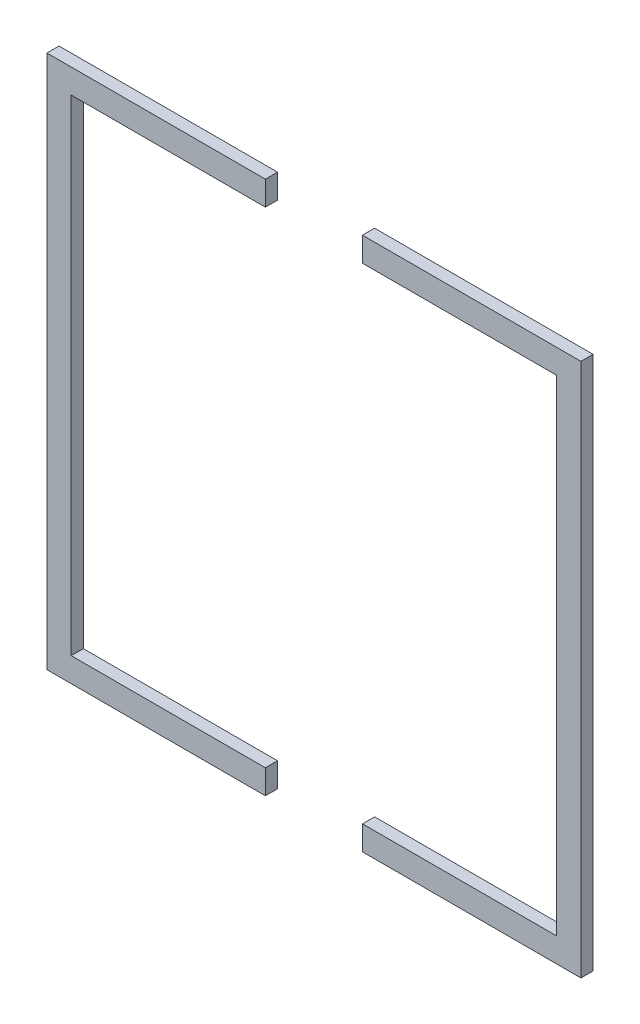
ISO-10303-21;
HEADER;
FILE_DESCRIPTION(('STEP AP214'),'2;1');
FILE_NAME('part.step','',(''),(''),'','','');
FILE_SCHEMA(('AUTOMOTIVE_DESIGN { 1 0 10303 214 1 1 1 1 }'));
ENDSEC;
DATA;
#1=APPLICATION_CONTEXT('core data for automotive mechanical design processes');
#2=APPLICATION_PROTOCOL_DEFINITION('international standard','automotive_design',2000,#1);
#3=PRODUCT_CONTEXT('',#1,'mechanical');
#4=PRODUCT('Part','Part','',(#3));
#5=PRODUCT_RELATED_PRODUCT_CATEGORY('part','',(#4));
#6=PRODUCT_DEFINITION_FORMATION('','',#4);
#7=PRODUCT_DEFINITION_CONTEXT('part definition',#1,'design');
#8=PRODUCT_DEFINITION('design','',#6,#7);
#9=PRODUCT_DEFINITION_SHAPE('','',#8);
#10=(LENGTH_UNIT() NAMED_UNIT(*) SI_UNIT(.MILLI.,.METRE.));
#11=(NAMED_UNIT(*) PLANE_ANGLE_UNIT() SI_UNIT($,.RADIAN.));
#12=(NAMED_UNIT(*) SI_UNIT($,.STERADIAN.) SOLID_ANGLE_UNIT());
#13=UNCERTAINTY_MEASURE_WITH_UNIT(LENGTH_MEASURE(1.E-05),#10,'distance_accuracy_value','');
#14=(GEOMETRIC_REPRESENTATION_CONTEXT(3) GLOBAL_UNCERTAINTY_ASSIGNED_CONTEXT((#13)) GLOBAL_UNIT_ASSIGNED_CONTEXT((#10,
#11,#12)) REPRESENTATION_CONTEXT('',''));
#15=CARTESIAN_POINT('',(0.,0.,0.));
#16=DIRECTION('',(0.,0.,1.));
#17=DIRECTION('',(1.,0.,0.));
#18=AXIS2_PLACEMENT_3D('',#15,#16,#17);
#19=CARTESIAN_POINT('',(82.55,139.7,3.175));
#20=DIRECTION('',(0.,-1.,0.));
#21=DIRECTION('',(1.,0.,0.));
#22=AXIS2_PLACEMENT_3D('',#19,#20,#21);
#23=PLANE('',#22);
#24=DIRECTION('',(-1.,0.,0.));
#25=VECTOR('',#24,1.);
#26=CARTESIAN_POINT('',(82.55,139.7,0.));
#27=LINE('',#26,#25);
#28=CARTESIAN_POINT('',(139.7,139.7,0.));
#29=VERTEX_POINT('',#28);
#30=CARTESIAN_POINT('',(82.55,139.7,0.));
#31=VERTEX_POINT('',#30);
#32=EDGE_CURVE('E139',#29,#31,#27,.T.);
#33=ORIENTED_EDGE('',*,*,#32,.T.);
#34=DIRECTION('',(0.,0.,-1.));
#35=VECTOR('',#34,1.);
#36=CARTESIAN_POINT('',(82.55,139.7,3.175));
#37=LINE('',#36,#35);
#38=CARTESIAN_POINT('',(82.55,139.7,3.175));
#39=VERTEX_POINT('',#38);
#40=EDGE_CURVE('E12',#39,#31,#37,.T.);
#41=ORIENTED_EDGE('',*,*,#40,.F.);
#42=DIRECTION('',(-1.,0.,0.));
#43=VECTOR('',#42,1.);
#44=CARTESIAN_POINT('',(82.55,139.7,3.175));
#45=LINE('',#44,#43);
#46=CARTESIAN_POINT('',(139.7,139.7,3.175));
#47=VERTEX_POINT('',#46);
#48=EDGE_CURVE('E153',#47,#39,#45,.T.);
#49=ORIENTED_EDGE('',*,*,#48,.F.);
#50=DIRECTION('',(0.,0.,-1.));
#51=VECTOR('',#50,1.);
#52=CARTESIAN_POINT('',(139.7,139.7,3.175));
#53=LINE('',#52,#51);
#54=EDGE_CURVE('E135',#47,#29,#53,.T.);
#55=ORIENTED_EDGE('',*,*,#54,.T.);
#56=EDGE_LOOP('',(#33,#41,#49,#55));
#57=FACE_BOUND('',#56,.T.);
#58=ADVANCED_FACE('F43',(#57),#23,.F.);
#59=CARTESIAN_POINT('',(82.55,133.35,3.175));
#60=DIRECTION('',(1.,0.,0.));
#61=DIRECTION('',(0.,0.,-1.));
#62=AXIS2_PLACEMENT_3D('',#59,#60,#61);
#63=PLANE('',#62);
#64=DIRECTION('',(0.,-1.,0.));
#65=VECTOR('',#64,1.);
#66=CARTESIAN_POINT('',(82.55,133.35,0.));
#67=LINE('',#66,#65);
#68=CARTESIAN_POINT('',(82.55,133.35,0.));
#69=VERTEX_POINT('',#68);
#70=EDGE_CURVE('E142',#31,#69,#67,.T.);
#71=ORIENTED_EDGE('',*,*,#70,.T.);
#72=DIRECTION('',(0.,0.,-1.));
#73=VECTOR('',#72,1.);
#74=CARTESIAN_POINT('',(82.55,133.35,3.175));
#75=LINE('',#74,#73);
#76=CARTESIAN_POINT('',(82.55,133.35,3.175));
#77=VERTEX_POINT('',#76);
#78=EDGE_CURVE('E51',#77,#69,#75,.T.);
#79=ORIENTED_EDGE('',*,*,#78,.F.);
#80=DIRECTION('',(0.,-1.,0.));
#81=VECTOR('',#80,1.);
#82=CARTESIAN_POINT('',(82.55,133.35,3.175));
#83=LINE('',#82,#81);
#84=EDGE_CURVE('E102',#39,#77,#83,.T.);
#85=ORIENTED_EDGE('',*,*,#84,.F.);
#86=ORIENTED_EDGE('',*,*,#40,.T.);
#87=EDGE_LOOP('',(#71,#79,#85,#86));
#88=FACE_BOUND('',#87,.T.);
#89=ADVANCED_FACE('F188',(#88),#63,.F.);
#90=CARTESIAN_POINT('',(82.55,133.35,3.175));
#91=DIRECTION('',(0.,1.,0.));
#92=DIRECTION('',(0.,0.,1.));
#93=AXIS2_PLACEMENT_3D('',#90,#91,#92);
#94=PLANE('',#93);
#95=DIRECTION('',(1.,0.,0.));
#96=VECTOR('',#95,1.);
#97=CARTESIAN_POINT('',(82.55,133.35,0.));
#98=LINE('',#97,#96);
#99=CARTESIAN_POINT('',(133.35,133.35,0.));
#100=VERTEX_POINT('',#99);
#101=EDGE_CURVE('E144',#69,#100,#98,.T.);
#102=ORIENTED_EDGE('',*,*,#101,.T.);
#103=DIRECTION('',(0.,0.,-1.));
#104=VECTOR('',#103,1.);
#105=CARTESIAN_POINT('',(133.35,133.35,3.175));
#106=LINE('',#105,#104);
#107=CARTESIAN_POINT('',(133.35,133.35,3.175));
#108=VERTEX_POINT('',#107);
#109=EDGE_CURVE('E160',#108,#100,#106,.T.);
#110=ORIENTED_EDGE('',*,*,#109,.F.);
#111=DIRECTION('',(1.,0.,0.));
#112=VECTOR('',#111,1.);
#113=CARTESIAN_POINT('',(82.55,133.35,3.175));
#114=LINE('',#113,#112);
#115=EDGE_CURVE('E168',#77,#108,#114,.T.);
#116=ORIENTED_EDGE('',*,*,#115,.F.);
#117=ORIENTED_EDGE('',*,*,#78,.T.);
#118=EDGE_LOOP('',(#102,#110,#116,#117));
#119=FACE_BOUND('',#118,.T.);
#120=ADVANCED_FACE('F166',(#119),#94,.F.);
#121=CARTESIAN_POINT('',(133.35,133.35,3.175));
#122=DIRECTION('',(1.,0.,0.));
#123=DIRECTION('',(0.,1.,0.));
#124=AXIS2_PLACEMENT_3D('',#121,#122,#123);
#125=PLANE('',#124);
#126=DIRECTION('',(0.,-1.,0.));
#127=VECTOR('',#126,1.);
#128=CARTESIAN_POINT('',(133.35,133.35,0.));
#129=LINE('',#128,#127);
#130=CARTESIAN_POINT('',(133.35,6.35,0.));
#131=VERTEX_POINT('',#130);
#132=EDGE_CURVE('E146',#100,#131,#129,.T.);
#133=ORIENTED_EDGE('',*,*,#132,.T.);
#134=DIRECTION('',(0.,0.,-1.));
#135=VECTOR('',#134,1.);
#136=CARTESIAN_POINT('',(133.35,6.35,3.175));
#137=LINE('',#136,#135);
#138=CARTESIAN_POINT('',(133.35,6.35,3.175));
#139=VERTEX_POINT('',#138);
#140=EDGE_CURVE('E157',#139,#131,#137,.T.);
#141=ORIENTED_EDGE('',*,*,#140,.F.);
#142=DIRECTION('',(0.,-1.,0.));
#143=VECTOR('',#142,1.);
#144=CARTESIAN_POINT('',(133.35,133.35,3.175));
#145=LINE('',#144,#143);
#146=EDGE_CURVE('E180',#108,#139,#145,.T.);
#147=ORIENTED_EDGE('',*,*,#146,.F.);
#148=ORIENTED_EDGE('',*,*,#109,.T.);
#149=EDGE_LOOP('',(#133,#141,#147,#148));
#150=FACE_BOUND('',#149,.T.);
#151=ADVANCED_FACE('F176',(#150),#125,.F.);
#152=CARTESIAN_POINT('',(82.55,6.35,3.175));
#153=DIRECTION('',(0.,-1.,0.));
#154=DIRECTION('',(0.,0.,-1.));
#155=AXIS2_PLACEMENT_3D('',#152,#153,#154);
#156=PLANE('',#155);
#157=DIRECTION('',(-1.,0.,0.));
#158=VECTOR('',#157,1.);
#159=CARTESIAN_POINT('',(82.55,6.35,0.));
#160=LINE('',#159,#158);
#161=CARTESIAN_POINT('',(82.55,6.35,0.));
#162=VERTEX_POINT('',#161);
#163=EDGE_CURVE('E148',#131,#162,#160,.T.);
#164=ORIENTED_EDGE('',*,*,#163,.T.);
#165=DIRECTION('',(0.,0.,-1.));
#166=VECTOR('',#165,1.);
#167=CARTESIAN_POINT('',(82.55,6.35,3.175));
#168=LINE('',#167,#166);
#169=CARTESIAN_POINT('',(82.55,6.35,3.175));
#170=VERTEX_POINT('',#169);
#171=EDGE_CURVE('E130',#170,#162,#168,.T.);
#172=ORIENTED_EDGE('',*,*,#171,.F.);
#173=DIRECTION('',(-1.,0.,0.));
#174=VECTOR('',#173,1.);
#175=CARTESIAN_POINT('',(82.55,6.35,3.175));
#176=LINE('',#175,#174);
#177=EDGE_CURVE('E121',#139,#170,#176,.T.);
#178=ORIENTED_EDGE('',*,*,#177,.F.);
#179=ORIENTED_EDGE('',*,*,#140,.T.);
#180=EDGE_LOOP('',(#164,#172,#178,#179));
#181=FACE_BOUND('',#180,.T.);
#182=ADVANCED_FACE('F179',(#181),#156,.F.);
#183=CARTESIAN_POINT('',(82.55,6.35,3.175));
#184=DIRECTION('',(1.,0.,0.));
#185=DIRECTION('',(0.,0.,-1.));
#186=AXIS2_PLACEMENT_3D('',#183,#184,#185);
#187=PLANE('',#186);
#188=DIRECTION('',(0.,-1.,0.));
#189=VECTOR('',#188,1.);
#190=CARTESIAN_POINT('',(82.55,6.35,0.));
#191=LINE('',#190,#189);
#192=CARTESIAN_POINT('',(82.55,0.,0.));
#193=VERTEX_POINT('',#192);
#194=EDGE_CURVE('E129',#162,#193,#191,.T.);
#195=ORIENTED_EDGE('',*,*,#194,.T.);
#196=DIRECTION('',(0.,0.,-1.));
#197=VECTOR('',#196,1.);
#198=CARTESIAN_POINT('',(82.55,0.,3.175));
#199=LINE('',#198,#197);
#200=CARTESIAN_POINT('',(82.55,0.,3.175));
#201=VERTEX_POINT('',#200);
#202=EDGE_CURVE('E126',#201,#193,#199,.T.);
#203=ORIENTED_EDGE('',*,*,#202,.F.);
#204=DIRECTION('',(0.,-1.,0.));
#205=VECTOR('',#204,1.);
#206=CARTESIAN_POINT('',(82.55,6.35,3.175));
#207=LINE('',#206,#205);
#208=EDGE_CURVE('E115',#170,#201,#207,.T.);
#209=ORIENTED_EDGE('',*,*,#208,.F.);
#210=ORIENTED_EDGE('',*,*,#171,.T.);
#211=EDGE_LOOP('',(#195,#203,#209,#210));
#212=FACE_BOUND('',#211,.T.);
#213=ADVANCED_FACE('F127',(#212),#187,.F.);
#214=CARTESIAN_POINT('',(82.55,0.,3.175));
#215=DIRECTION('',(0.,1.,0.));
#216=DIRECTION('',(0.,0.,1.));
#217=AXIS2_PLACEMENT_3D('',#214,#215,#216);
#218=PLANE('',#217);
#219=DIRECTION('',(1.,0.,0.));
#220=VECTOR('',#219,1.);
#221=CARTESIAN_POINT('',(82.55,0.,0.));
#222=LINE('',#221,#220);
#223=CARTESIAN_POINT('',(139.7,0.,0.));
#224=VERTEX_POINT('',#223);
#225=EDGE_CURVE('E88',#193,#224,#222,.T.);
#226=ORIENTED_EDGE('',*,*,#225,.T.);
#227=DIRECTION('',(0.,0.,-1.));
#228=VECTOR('',#227,1.);
#229=CARTESIAN_POINT('',(139.7,0.,3.175));
#230=LINE('',#229,#228);
#231=CARTESIAN_POINT('',(139.7,0.,3.175));
#232=VERTEX_POINT('',#231);
#233=EDGE_CURVE('E131',#232,#224,#230,.T.);
#234=ORIENTED_EDGE('',*,*,#233,.F.);
#235=DIRECTION('',(1.,0.,0.));
#236=VECTOR('',#235,1.);
#237=CARTESIAN_POINT('',(82.55,0.,3.175));
#238=LINE('',#237,#236);
#239=EDGE_CURVE('E119',#201,#232,#238,.T.);
#240=ORIENTED_EDGE('',*,*,#239,.F.);
#241=ORIENTED_EDGE('',*,*,#202,.T.);
#242=EDGE_LOOP('',(#226,#234,#240,#241));
#243=FACE_BOUND('',#242,.T.);
#244=ADVANCED_FACE('F133',(#243),#218,.F.);
#245=CARTESIAN_POINT('',(139.7,0.,3.175));
#246=DIRECTION('',(-1.,0.,0.));
#247=DIRECTION('',(0.,0.,1.));
#248=AXIS2_PLACEMENT_3D('',#245,#246,#247);
#249=PLANE('',#248);
#250=DIRECTION('',(0.,1.,0.));
#251=VECTOR('',#250,1.);
#252=CARTESIAN_POINT('',(139.7,0.,0.));
#253=LINE('',#252,#251);
#254=EDGE_CURVE('E94',#224,#29,#253,.T.);
#255=ORIENTED_EDGE('',*,*,#254,.T.);
#256=ORIENTED_EDGE('',*,*,#54,.F.);
#257=DIRECTION('',(0.,1.,0.));
#258=VECTOR('',#257,1.);
#259=CARTESIAN_POINT('',(139.7,0.,3.175));
#260=LINE('',#259,#258);
#261=EDGE_CURVE('E59',#232,#47,#260,.T.);
#262=ORIENTED_EDGE('',*,*,#261,.F.);
#263=ORIENTED_EDGE('',*,*,#233,.T.);
#264=EDGE_LOOP('',(#255,#256,#262,#263));
#265=FACE_BOUND('',#264,.T.);
#266=ADVANCED_FACE('F204',(#265),#249,.F.);
#267=CARTESIAN_POINT('',(0.,0.,3.175));
#268=DIRECTION('',(0.,0.,1.));
#269=DIRECTION('',(1.,0.,0.));
#270=AXIS2_PLACEMENT_3D('',#267,#268,#269);
#271=PLANE('',#270);
#272=ORIENTED_EDGE('',*,*,#48,.T.);
#273=ORIENTED_EDGE('',*,*,#84,.T.);
#274=ORIENTED_EDGE('',*,*,#115,.T.);
#275=ORIENTED_EDGE('',*,*,#146,.T.);
#276=ORIENTED_EDGE('',*,*,#177,.T.);
#277=ORIENTED_EDGE('',*,*,#208,.T.);
#278=ORIENTED_EDGE('',*,*,#239,.T.);
#279=ORIENTED_EDGE('',*,*,#261,.T.);
#280=EDGE_LOOP('',(#272,#273,#274,#275,#276,#277,#278,#279));
#281=FACE_BOUND('',#280,.T.);
#282=ADVANCED_FACE('F117',(#281),#271,.T.);
#283=CARTESIAN_POINT('',(0.,0.,0.));
#284=DIRECTION('',(0.,0.,1.));
#285=DIRECTION('',(1.,0.,0.));
#286=AXIS2_PLACEMENT_3D('',#283,#284,#285);
#287=PLANE('',#286);
#288=ORIENTED_EDGE('',*,*,#32,.F.);
#289=ORIENTED_EDGE('',*,*,#254,.F.);
#290=ORIENTED_EDGE('',*,*,#225,.F.);
#291=ORIENTED_EDGE('',*,*,#194,.F.);
#292=ORIENTED_EDGE('',*,*,#163,.F.);
#293=ORIENTED_EDGE('',*,*,#132,.F.);
#294=ORIENTED_EDGE('',*,*,#101,.F.);
#295=ORIENTED_EDGE('',*,*,#70,.F.);
#296=EDGE_LOOP('',(#288,#289,#290,#291,#292,#293,#294,#295));
#297=FACE_BOUND('',#296,.T.);
#298=ADVANCED_FACE('F172',(#297),#287,.F.);
#299=CLOSED_SHELL('',(#58,#89,#120,#151,#182,#213,#244,#266,#282,#298));
#300=MANIFOLD_SOLID_BREP('B2',#299);
#301=CARTESIAN_POINT('',(0.,0.,3.175));
#302=DIRECTION('',(1.,0.,0.));
#303=DIRECTION('',(0.,0.,-1.));
#304=AXIS2_PLACEMENT_3D('',#301,#302,#303);
#305=PLANE('',#304);
#306=DIRECTION('',(0.,-1.,0.));
#307=VECTOR('',#306,1.);
#308=CARTESIAN_POINT('',(0.,0.,0.));
#309=LINE('',#308,#307);
#310=CARTESIAN_POINT('',(0.,139.7,0.));
#311=VERTEX_POINT('',#310);
#312=CARTESIAN_POINT('',(0.,0.,0.));
#313=VERTEX_POINT('',#312);
#314=EDGE_CURVE('E367',#311,#313,#309,.T.);
#315=ORIENTED_EDGE('',*,*,#314,.T.);
#316=DIRECTION('',(0.,0.,-1.));
#317=VECTOR('',#316,1.);
#318=CARTESIAN_POINT('',(0.,0.,3.175));
#319=LINE('',#318,#317);
#320=CARTESIAN_POINT('',(0.,0.,3.175));
#321=VERTEX_POINT('',#320);
#322=EDGE_CURVE('E41',#321,#313,#319,.T.);
#323=ORIENTED_EDGE('',*,*,#322,.F.);
#324=DIRECTION('',(0.,-1.,0.));
#325=VECTOR('',#324,1.);
#326=CARTESIAN_POINT('',(0.,0.,3.175));
#327=LINE('',#326,#325);
#328=CARTESIAN_POINT('',(0.,139.7,3.175));
#329=VERTEX_POINT('',#328);
#330=EDGE_CURVE('E381',#329,#321,#327,.T.);
#331=ORIENTED_EDGE('',*,*,#330,.F.);
#332=DIRECTION('',(0.,0.,-1.));
#333=VECTOR('',#332,1.);
#334=CARTESIAN_POINT('',(0.,139.7,3.175));
#335=LINE('',#334,#333);
#336=EDGE_CURVE('E363',#329,#311,#335,.T.);
#337=ORIENTED_EDGE('',*,*,#336,.T.);
#338=EDGE_LOOP('',(#315,#323,#331,#337));
#339=FACE_BOUND('',#338,.T.);
#340=ADVANCED_FACE('F271',(#339),#305,.F.);
#341=CARTESIAN_POINT('',(0.,0.,3.175));
#342=DIRECTION('',(0.,1.,0.));
#343=DIRECTION('',(0.,0.,1.));
#344=AXIS2_PLACEMENT_3D('',#341,#342,#343);
#345=PLANE('',#344);
#346=DIRECTION('',(1.,0.,0.));
#347=VECTOR('',#346,1.);
#348=CARTESIAN_POINT('',(0.,0.,0.));
#349=LINE('',#348,#347);
#350=CARTESIAN_POINT('',(57.15,0.,0.));
#351=VERTEX_POINT('',#350);
#352=EDGE_CURVE('E370',#313,#351,#349,.T.);
#353=ORIENTED_EDGE('',*,*,#352,.T.);
#354=DIRECTION('',(0.,0.,-1.));
#355=VECTOR('',#354,1.);
#356=CARTESIAN_POINT('',(57.15,0.,3.175));
#357=LINE('',#356,#355);
#358=CARTESIAN_POINT('',(57.15,0.,3.175));
#359=VERTEX_POINT('',#358);
#360=EDGE_CURVE('E279',#359,#351,#357,.T.);
#361=ORIENTED_EDGE('',*,*,#360,.F.);
#362=DIRECTION('',(1.,0.,0.));
#363=VECTOR('',#362,1.);
#364=CARTESIAN_POINT('',(0.,0.,3.175));
#365=LINE('',#364,#363);
#366=EDGE_CURVE('E330',#321,#359,#365,.T.);
#367=ORIENTED_EDGE('',*,*,#366,.F.);
#368=ORIENTED_EDGE('',*,*,#322,.T.);
#369=EDGE_LOOP('',(#353,#361,#367,#368));
#370=FACE_BOUND('',#369,.T.);
#371=ADVANCED_FACE('F416',(#370),#345,.F.);
#372=CARTESIAN_POINT('',(57.15,6.35,3.175));
#373=DIRECTION('',(-1.,0.,0.));
#374=DIRECTION('',(0.,0.,1.));
#375=AXIS2_PLACEMENT_3D('',#372,#373,#374);
#376=PLANE('',#375);
#377=DIRECTION('',(0.,1.,0.));
#378=VECTOR('',#377,1.);
#379=CARTESIAN_POINT('',(57.15,6.35,0.));
#380=LINE('',#379,#378);
#381=CARTESIAN_POINT('',(57.15,6.35,0.));
#382=VERTEX_POINT('',#381);
#383=EDGE_CURVE('E372',#351,#382,#380,.T.);
#384=ORIENTED_EDGE('',*,*,#383,.T.);
#385=DIRECTION('',(0.,0.,-1.));
#386=VECTOR('',#385,1.);
#387=CARTESIAN_POINT('',(57.15,6.35,3.175));
#388=LINE('',#387,#386);
#389=CARTESIAN_POINT('',(57.15,6.35,3.175));
#390=VERTEX_POINT('',#389);
#391=EDGE_CURVE('E388',#390,#382,#388,.T.);
#392=ORIENTED_EDGE('',*,*,#391,.F.);
#393=DIRECTION('',(0.,1.,0.));
#394=VECTOR('',#393,1.);
#395=CARTESIAN_POINT('',(57.15,6.35,3.175));
#396=LINE('',#395,#394);
#397=EDGE_CURVE('E396',#359,#390,#396,.T.);
#398=ORIENTED_EDGE('',*,*,#397,.F.);
#399=ORIENTED_EDGE('',*,*,#360,.T.);
#400=EDGE_LOOP('',(#384,#392,#398,#399));
#401=FACE_BOUND('',#400,.T.);
#402=ADVANCED_FACE('F394',(#401),#376,.F.);
#403=CARTESIAN_POINT('',(6.35,6.35,3.175));
#404=DIRECTION('',(0.,-1.,0.));
#405=DIRECTION('',(0.,0.,-1.));
#406=AXIS2_PLACEMENT_3D('',#403,#404,#405);
#407=PLANE('',#406);
#408=DIRECTION('',(-1.,0.,0.));
#409=VECTOR('',#408,1.);
#410=CARTESIAN_POINT('',(6.35,6.35,0.));
#411=LINE('',#410,#409);
#412=CARTESIAN_POINT('',(6.35,6.35,0.));
#413=VERTEX_POINT('',#412);
#414=EDGE_CURVE('E374',#382,#413,#411,.T.);
#415=ORIENTED_EDGE('',*,*,#414,.T.);
#416=DIRECTION('',(0.,0.,-1.));
#417=VECTOR('',#416,1.);
#418=CARTESIAN_POINT('',(6.35,6.35,3.175));
#419=LINE('',#418,#417);
#420=CARTESIAN_POINT('',(6.35,6.35,3.175));
#421=VERTEX_POINT('',#420);
#422=EDGE_CURVE('E385',#421,#413,#419,.T.);
#423=ORIENTED_EDGE('',*,*,#422,.F.);
#424=DIRECTION('',(-1.,0.,0.));
#425=VECTOR('',#424,1.);
#426=CARTESIAN_POINT('',(6.35,6.35,3.175));
#427=LINE('',#426,#425);
#428=EDGE_CURVE('E408',#390,#421,#427,.T.);
#429=ORIENTED_EDGE('',*,*,#428,.F.);
#430=ORIENTED_EDGE('',*,*,#391,.T.);
#431=EDGE_LOOP('',(#415,#423,#429,#430));
#432=FACE_BOUND('',#431,.T.);
#433=ADVANCED_FACE('F404',(#432),#407,.F.);
#434=CARTESIAN_POINT('',(6.35,133.35,3.175));
#435=DIRECTION('',(-1.,0.,0.));
#436=DIRECTION('',(0.,0.,1.));
#437=AXIS2_PLACEMENT_3D('',#434,#435,#436);
#438=PLANE('',#437);
#439=DIRECTION('',(0.,1.,0.));
#440=VECTOR('',#439,1.);
#441=CARTESIAN_POINT('',(6.35,133.35,0.));
#442=LINE('',#441,#440);
#443=CARTESIAN_POINT('',(6.35,133.35,0.));
#444=VERTEX_POINT('',#443);
#445=EDGE_CURVE('E376',#413,#444,#442,.T.);
#446=ORIENTED_EDGE('',*,*,#445,.T.);
#447=DIRECTION('',(0.,0.,-1.));
#448=VECTOR('',#447,1.);
#449=CARTESIAN_POINT('',(6.35,133.35,3.175));
#450=LINE('',#449,#448);
#451=CARTESIAN_POINT('',(6.35,133.35,3.175));
#452=VERTEX_POINT('',#451);
#453=EDGE_CURVE('E358',#452,#444,#450,.T.);
#454=ORIENTED_EDGE('',*,*,#453,.F.);
#455=DIRECTION('',(0.,1.,0.));
#456=VECTOR('',#455,1.);
#457=CARTESIAN_POINT('',(6.35,133.35,3.175));
#458=LINE('',#457,#456);
#459=EDGE_CURVE('E349',#421,#452,#458,.T.);
#460=ORIENTED_EDGE('',*,*,#459,.F.);
#461=ORIENTED_EDGE('',*,*,#422,.T.);
#462=EDGE_LOOP('',(#446,#454,#460,#461));
#463=FACE_BOUND('',#462,.T.);
#464=ADVANCED_FACE('F407',(#463),#438,.F.);
#465=CARTESIAN_POINT('',(6.35,133.35,3.175));
#466=DIRECTION('',(0.,1.,0.));
#467=DIRECTION('',(0.,0.,1.));
#468=AXIS2_PLACEMENT_3D('',#465,#466,#467);
#469=PLANE('',#468);
#470=DIRECTION('',(1.,0.,0.));
#471=VECTOR('',#470,1.);
#472=CARTESIAN_POINT('',(6.35,133.35,0.));
#473=LINE('',#472,#471);
#474=CARTESIAN_POINT('',(57.15,133.35,0.));
#475=VERTEX_POINT('',#474);
#476=EDGE_CURVE('E357',#444,#475,#473,.T.);
#477=ORIENTED_EDGE('',*,*,#476,.T.);
#478=DIRECTION('',(0.,0.,-1.));
#479=VECTOR('',#478,1.);
#480=CARTESIAN_POINT('',(57.15,133.35,3.175));
#481=LINE('',#480,#479);
#482=CARTESIAN_POINT('',(57.15,133.35,3.175));
#483=VERTEX_POINT('',#482);
#484=EDGE_CURVE('E354',#483,#475,#481,.T.);
#485=ORIENTED_EDGE('',*,*,#484,.F.);
#486=DIRECTION('',(1.,0.,0.));
#487=VECTOR('',#486,1.);
#488=CARTESIAN_POINT('',(6.35,133.35,3.175));
#489=LINE('',#488,#487);
#490=EDGE_CURVE('E343',#452,#483,#489,.T.);
#491=ORIENTED_EDGE('',*,*,#490,.F.);
#492=ORIENTED_EDGE('',*,*,#453,.T.);
#493=EDGE_LOOP('',(#477,#485,#491,#492));
#494=FACE_BOUND('',#493,.T.);
#495=ADVANCED_FACE('F355',(#494),#469,.F.);
#496=CARTESIAN_POINT('',(57.15,139.7,3.175));
#497=DIRECTION('',(-1.,0.,0.));
#498=DIRECTION('',(0.,0.,1.));
#499=AXIS2_PLACEMENT_3D('',#496,#497,#498);
#500=PLANE('',#499);
#501=DIRECTION('',(0.,1.,0.));
#502=VECTOR('',#501,1.);
#503=CARTESIAN_POINT('',(57.15,139.7,0.));
#504=LINE('',#503,#502);
#505=CARTESIAN_POINT('',(57.15,139.7,0.));
#506=VERTEX_POINT('',#505);
#507=EDGE_CURVE('E316',#475,#506,#504,.T.);
#508=ORIENTED_EDGE('',*,*,#507,.T.);
#509=DIRECTION('',(0.,0.,-1.));
#510=VECTOR('',#509,1.);
#511=CARTESIAN_POINT('',(57.15,139.7,3.175));
#512=LINE('',#511,#510);
#513=CARTESIAN_POINT('',(57.15,139.7,3.175));
#514=VERTEX_POINT('',#513);
#515=EDGE_CURVE('E359',#514,#506,#512,.T.);
#516=ORIENTED_EDGE('',*,*,#515,.F.);
#517=DIRECTION('',(0.,1.,0.));
#518=VECTOR('',#517,1.);
#519=CARTESIAN_POINT('',(57.15,139.7,3.175));
#520=LINE('',#519,#518);
#521=EDGE_CURVE('E347',#483,#514,#520,.T.);
#522=ORIENTED_EDGE('',*,*,#521,.F.);
#523=ORIENTED_EDGE('',*,*,#484,.T.);
#524=EDGE_LOOP('',(#508,#516,#522,#523));
#525=FACE_BOUND('',#524,.T.);
#526=ADVANCED_FACE('F361',(#525),#500,.F.);
#527=CARTESIAN_POINT('',(57.15,139.7,3.175));
#528=DIRECTION('',(0.,-1.,0.));
#529=DIRECTION('',(0.,0.,-1.));
#530=AXIS2_PLACEMENT_3D('',#527,#528,#529);
#531=PLANE('',#530);
#532=DIRECTION('',(-1.,0.,0.));
#533=VECTOR('',#532,1.);
#534=CARTESIAN_POINT('',(57.15,139.7,0.));
#535=LINE('',#534,#533);
#536=EDGE_CURVE('E322',#506,#311,#535,.T.);
#537=ORIENTED_EDGE('',*,*,#536,.T.);
#538=ORIENTED_EDGE('',*,*,#336,.F.);
#539=DIRECTION('',(-1.,0.,0.));
#540=VECTOR('',#539,1.);
#541=CARTESIAN_POINT('',(57.15,139.7,3.175));
#542=LINE('',#541,#540);
#543=EDGE_CURVE('E287',#514,#329,#542,.T.);
#544=ORIENTED_EDGE('',*,*,#543,.F.);
#545=ORIENTED_EDGE('',*,*,#515,.T.);
#546=EDGE_LOOP('',(#537,#538,#544,#545));
#547=FACE_BOUND('',#546,.T.);
#548=ADVANCED_FACE('F432',(#547),#531,.F.);
#549=CARTESIAN_POINT('',(0.,0.,3.175));
#550=DIRECTION('',(0.,0.,1.));
#551=DIRECTION('',(1.,0.,0.));
#552=AXIS2_PLACEMENT_3D('',#549,#550,#551);
#553=PLANE('',#552);
#554=ORIENTED_EDGE('',*,*,#330,.T.);
#555=ORIENTED_EDGE('',*,*,#366,.T.);
#556=ORIENTED_EDGE('',*,*,#397,.T.);
#557=ORIENTED_EDGE('',*,*,#428,.T.);
#558=ORIENTED_EDGE('',*,*,#459,.T.);
#559=ORIENTED_EDGE('',*,*,#490,.T.);
#560=ORIENTED_EDGE('',*,*,#521,.T.);
#561=ORIENTED_EDGE('',*,*,#543,.T.);
#562=EDGE_LOOP('',(#554,#555,#556,#557,#558,#559,#560,#561));
#563=FACE_BOUND('',#562,.T.);
#564=ADVANCED_FACE('F345',(#563),#553,.T.);
#565=CARTESIAN_POINT('',(0.,0.,0.));
#566=DIRECTION('',(0.,0.,1.));
#567=DIRECTION('',(1.,0.,0.));
#568=AXIS2_PLACEMENT_3D('',#565,#566,#567);
#569=PLANE('',#568);
#570=ORIENTED_EDGE('',*,*,#314,.F.);
#571=ORIENTED_EDGE('',*,*,#536,.F.);
#572=ORIENTED_EDGE('',*,*,#507,.F.);
#573=ORIENTED_EDGE('',*,*,#476,.F.);
#574=ORIENTED_EDGE('',*,*,#445,.F.);
#575=ORIENTED_EDGE('',*,*,#414,.F.);
#576=ORIENTED_EDGE('',*,*,#383,.F.);
#577=ORIENTED_EDGE('',*,*,#352,.F.);
#578=EDGE_LOOP('',(#570,#571,#572,#573,#574,#575,#576,#577));
#579=FACE_BOUND('',#578,.T.);
#580=ADVANCED_FACE('F400',(#579),#569,.F.);
#581=CLOSED_SHELL('',(#340,#371,#402,#433,#464,#495,#526,#548,#564,#580));
#582=MANIFOLD_SOLID_BREP('B6',#581);
#583=ADVANCED_BREP_SHAPE_REPRESENTATION('',(#18,#300,#582),#14);
#584=SHAPE_DEFINITION_REPRESENTATION(#9,#583);
ENDSEC;
END-ISO-10303-21;
